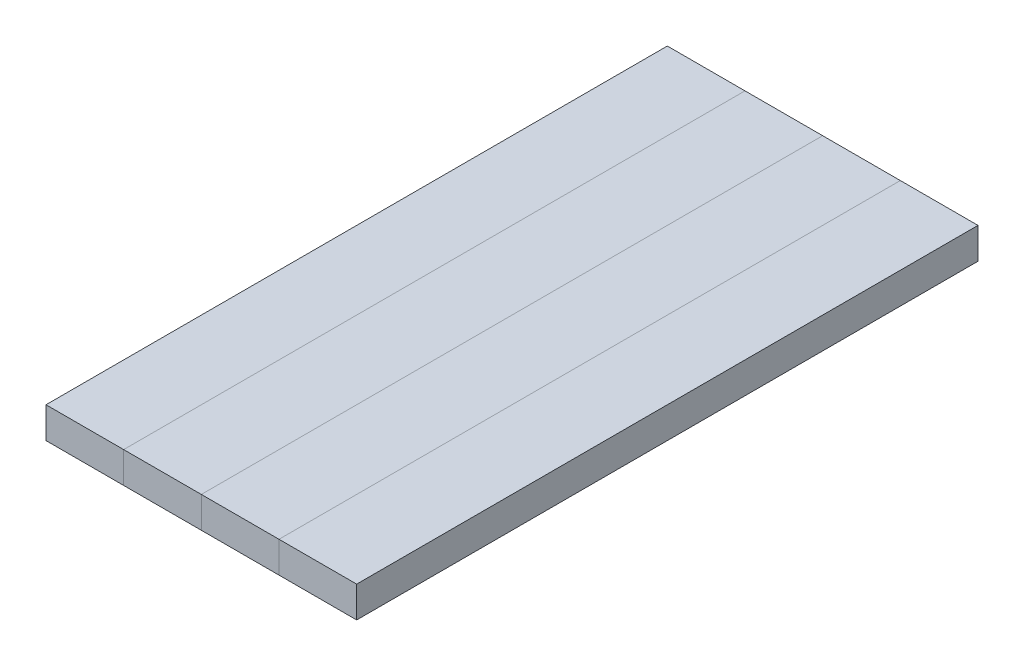
ISO-10303-21;
HEADER;
FILE_DESCRIPTION(('STEP AP214'),'2;1');
FILE_NAME('part.step','',(''),(''),'','','');
FILE_SCHEMA(('AUTOMOTIVE_DESIGN { 1 0 10303 214 1 1 1 1 }'));
ENDSEC;
DATA;
#1=APPLICATION_CONTEXT('core data for automotive mechanical design processes');
#2=APPLICATION_PROTOCOL_DEFINITION('international standard','automotive_design',2000,#1);
#3=PRODUCT_CONTEXT('',#1,'mechanical');
#4=PRODUCT('Part','Part','',(#3));
#5=PRODUCT_RELATED_PRODUCT_CATEGORY('part','',(#4));
#6=PRODUCT_DEFINITION_FORMATION('','',#4);
#7=PRODUCT_DEFINITION_CONTEXT('part definition',#1,'design');
#8=PRODUCT_DEFINITION('design','',#6,#7);
#9=PRODUCT_DEFINITION_SHAPE('','',#8);
#10=(LENGTH_UNIT() NAMED_UNIT(*) SI_UNIT(.MILLI.,.METRE.));
#11=(NAMED_UNIT(*) PLANE_ANGLE_UNIT() SI_UNIT($,.RADIAN.));
#12=(NAMED_UNIT(*) SI_UNIT($,.STERADIAN.) SOLID_ANGLE_UNIT());
#13=UNCERTAINTY_MEASURE_WITH_UNIT(LENGTH_MEASURE(1.E-05),#10,'distance_accuracy_value','');
#14=(GEOMETRIC_REPRESENTATION_CONTEXT(3) GLOBAL_UNCERTAINTY_ASSIGNED_CONTEXT((#13)) GLOBAL_UNIT_ASSIGNED_CONTEXT((#10,
#11,#12)) REPRESENTATION_CONTEXT('',''));
#15=CARTESIAN_POINT('',(0.,0.,0.));
#16=DIRECTION('',(0.,0.,1.));
#17=DIRECTION('',(1.,0.,0.));
#18=AXIS2_PLACEMENT_3D('',#15,#16,#17);
#19=CARTESIAN_POINT('',(0.,0.,0.));
#20=DIRECTION('',(0.,1.,0.));
#21=DIRECTION('',(0.,0.,1.));
#22=AXIS2_PLACEMENT_3D('',#19,#20,#21);
#23=PLANE('',#22);
#24=DIRECTION('',(0.,0.,1.));
#25=VECTOR('',#24,1.);
#26=CARTESIAN_POINT('',(-12.5,0.,-100.));
#27=LINE('',#26,#25);
#28=CARTESIAN_POINT('',(-12.5,0.,-100.));
#29=VERTEX_POINT('',#28);
#30=CARTESIAN_POINT('',(-12.5,0.,100.));
#31=VERTEX_POINT('',#30);
#32=EDGE_CURVE('P0_E79',#29,#31,#27,.T.);
#33=ORIENTED_EDGE('',*,*,#32,.F.);
#34=DIRECTION('',(-1.,0.,0.));
#35=VECTOR('',#34,1.);
#36=CARTESIAN_POINT('',(12.5,0.,-100.));
#37=LINE('',#36,#35);
#38=CARTESIAN_POINT('',(12.5,0.,-100.));
#39=VERTEX_POINT('',#38);
#40=EDGE_CURVE('P0_E55',#39,#29,#37,.T.);
#41=ORIENTED_EDGE('',*,*,#40,.F.);
#42=DIRECTION('',(0.,0.,-1.));
#43=VECTOR('',#42,1.);
#44=CARTESIAN_POINT('',(12.5,0.,100.));
#45=LINE('',#44,#43);
#46=CARTESIAN_POINT('',(12.5,0.,100.));
#47=VERTEX_POINT('',#46);
#48=EDGE_CURVE('P0_E57',#47,#39,#45,.T.);
#49=ORIENTED_EDGE('',*,*,#48,.F.);
#50=DIRECTION('',(1.,0.,0.));
#51=VECTOR('',#50,1.);
#52=CARTESIAN_POINT('',(-12.5,0.,100.));
#53=LINE('',#52,#51);
#54=EDGE_CURVE('P0_E20',#31,#47,#53,.T.);
#55=ORIENTED_EDGE('',*,*,#54,.F.);
#56=EDGE_LOOP('',(#33,#41,#49,#55));
#57=FACE_BOUND('',#56,.T.);
#58=ADVANCED_FACE('P0_F17',(#57),#23,.F.);
#59=CARTESIAN_POINT('',(-12.5,0.,100.));
#60=DIRECTION('',(0.,0.,1.));
#61=DIRECTION('',(1.,0.,0.));
#62=AXIS2_PLACEMENT_3D('',#59,#60,#61);
#63=PLANE('',#62);
#64=DIRECTION('',(1.,0.,0.));
#65=VECTOR('',#64,1.);
#66=CARTESIAN_POINT('',(0.,10.,100.));
#67=LINE('',#66,#65);
#68=CARTESIAN_POINT('',(-12.5,10.,100.));
#69=VERTEX_POINT('',#68);
#70=CARTESIAN_POINT('',(12.5,10.,100.));
#71=VERTEX_POINT('',#70);
#72=EDGE_CURVE('P0_E83',#69,#71,#67,.T.);
#73=ORIENTED_EDGE('',*,*,#72,.F.);
#74=DIRECTION('',(0.,1.,0.));
#75=VECTOR('',#74,1.);
#76=CARTESIAN_POINT('',(-12.5,0.,100.));
#77=LINE('',#76,#75);
#78=EDGE_CURVE('P0_E68',#31,#69,#77,.T.);
#79=ORIENTED_EDGE('',*,*,#78,.F.);
#80=ORIENTED_EDGE('',*,*,#54,.T.);
#81=DIRECTION('',(0.,1.,0.));
#82=VECTOR('',#81,1.);
#83=CARTESIAN_POINT('',(12.5,0.,100.));
#84=LINE('',#83,#82);
#85=EDGE_CURVE('P0_E63',#71,#47,#84,.F.);
#86=ORIENTED_EDGE('',*,*,#85,.F.);
#87=EDGE_LOOP('',(#73,#79,#80,#86));
#88=FACE_BOUND('',#87,.T.);
#89=ADVANCED_FACE('P0_F65',(#88),#63,.T.);
#90=CARTESIAN_POINT('',(12.5,0.,100.));
#91=DIRECTION('',(1.,0.,0.));
#92=DIRECTION('',(0.,0.,-1.));
#93=AXIS2_PLACEMENT_3D('',#90,#91,#92);
#94=PLANE('',#93);
#95=DIRECTION('',(0.,0.,1.));
#96=VECTOR('',#95,1.);
#97=CARTESIAN_POINT('',(12.5,10.,0.));
#98=LINE('',#97,#96);
#99=CARTESIAN_POINT('',(12.5,10.,-100.));
#100=VERTEX_POINT('',#99);
#101=EDGE_CURVE('P0_E72',#71,#100,#98,.F.);
#102=ORIENTED_EDGE('',*,*,#101,.F.);
#103=ORIENTED_EDGE('',*,*,#85,.T.);
#104=ORIENTED_EDGE('',*,*,#48,.T.);
#105=DIRECTION('',(0.,1.,0.));
#106=VECTOR('',#105,1.);
#107=CARTESIAN_POINT('',(12.5,0.,-100.));
#108=LINE('',#107,#106);
#109=EDGE_CURVE('P0_E75',#100,#39,#108,.F.);
#110=ORIENTED_EDGE('',*,*,#109,.F.);
#111=EDGE_LOOP('',(#102,#103,#104,#110));
#112=FACE_BOUND('',#111,.T.);
#113=ADVANCED_FACE('P0_F70',(#112),#94,.T.);
#114=CARTESIAN_POINT('',(12.5,0.,-100.));
#115=DIRECTION('',(0.,0.,-1.));
#116=DIRECTION('',(-1.,0.,0.));
#117=AXIS2_PLACEMENT_3D('',#114,#115,#116);
#118=PLANE('',#117);
#119=DIRECTION('',(1.,0.,0.));
#120=VECTOR('',#119,1.);
#121=CARTESIAN_POINT('',(0.,10.,-100.));
#122=LINE('',#121,#120);
#123=CARTESIAN_POINT('',(-12.5,10.,-100.));
#124=VERTEX_POINT('',#123);
#125=EDGE_CURVE('P0_E26',#100,#124,#122,.F.);
#126=ORIENTED_EDGE('',*,*,#125,.F.);
#127=ORIENTED_EDGE('',*,*,#109,.T.);
#128=ORIENTED_EDGE('',*,*,#40,.T.);
#129=DIRECTION('',(0.,1.,0.));
#130=VECTOR('',#129,1.);
#131=CARTESIAN_POINT('',(-12.5,0.,-100.));
#132=LINE('',#131,#130);
#133=EDGE_CURVE('P0_E35',#124,#29,#132,.F.);
#134=ORIENTED_EDGE('',*,*,#133,.F.);
#135=EDGE_LOOP('',(#126,#127,#128,#134));
#136=FACE_BOUND('',#135,.T.);
#137=ADVANCED_FACE('P0_F89',(#136),#118,.T.);
#138=CARTESIAN_POINT('',(-12.5,0.,-100.));
#139=DIRECTION('',(-1.,0.,0.));
#140=DIRECTION('',(0.,0.,1.));
#141=AXIS2_PLACEMENT_3D('',#138,#139,#140);
#142=PLANE('',#141);
#143=DIRECTION('',(0.,0.,1.));
#144=VECTOR('',#143,1.);
#145=CARTESIAN_POINT('',(-12.5,10.,0.));
#146=LINE('',#145,#144);
#147=EDGE_CURVE('P0_E11',#124,#69,#146,.T.);
#148=ORIENTED_EDGE('',*,*,#147,.F.);
#149=ORIENTED_EDGE('',*,*,#133,.T.);
#150=ORIENTED_EDGE('',*,*,#32,.T.);
#151=ORIENTED_EDGE('',*,*,#78,.T.);
#152=EDGE_LOOP('',(#148,#149,#150,#151));
#153=FACE_BOUND('',#152,.T.);
#154=ADVANCED_FACE('P0_F91',(#153),#142,.T.);
#155=CARTESIAN_POINT('',(0.,10.,0.));
#156=DIRECTION('',(0.,1.,0.));
#157=DIRECTION('',(0.,0.,1.));
#158=AXIS2_PLACEMENT_3D('',#155,#156,#157);
#159=PLANE('',#158);
#160=ORIENTED_EDGE('',*,*,#125,.T.);
#161=ORIENTED_EDGE('',*,*,#147,.T.);
#162=ORIENTED_EDGE('',*,*,#72,.T.);
#163=ORIENTED_EDGE('',*,*,#101,.T.);
#164=EDGE_LOOP('',(#160,#161,#162,#163));
#165=FACE_BOUND('',#164,.T.);
#166=ADVANCED_FACE('P0_F88',(#165),#159,.T.);
#167=CLOSED_SHELL('',(#58,#89,#113,#137,#154,#166));
#168=MANIFOLD_SOLID_BREP('P0_B1',#167);
#169=CARTESIAN_POINT('',(25.,0.,0.));
#170=DIRECTION('',(0.,1.,0.));
#171=DIRECTION('',(0.,0.,1.));
#172=AXIS2_PLACEMENT_3D('',#169,#170,#171);
#173=PLANE('',#172);
#174=DIRECTION('',(0.,0.,1.));
#175=VECTOR('',#174,1.);
#176=CARTESIAN_POINT('',(12.5,0.,-100.));
#177=LINE('',#176,#175);
#178=CARTESIAN_POINT('',(12.5,0.,-100.));
#179=VERTEX_POINT('',#178);
#180=CARTESIAN_POINT('',(12.5,0.,100.));
#181=VERTEX_POINT('',#180);
#182=EDGE_CURVE('P1_E79',#179,#181,#177,.T.);
#183=ORIENTED_EDGE('',*,*,#182,.F.);
#184=DIRECTION('',(-1.,0.,0.));
#185=VECTOR('',#184,1.);
#186=CARTESIAN_POINT('',(37.5,0.,-100.));
#187=LINE('',#186,#185);
#188=CARTESIAN_POINT('',(37.5,0.,-100.));
#189=VERTEX_POINT('',#188);
#190=EDGE_CURVE('P1_E55',#189,#179,#187,.T.);
#191=ORIENTED_EDGE('',*,*,#190,.F.);
#192=DIRECTION('',(0.,0.,-1.));
#193=VECTOR('',#192,1.);
#194=CARTESIAN_POINT('',(37.5,0.,100.));
#195=LINE('',#194,#193);
#196=CARTESIAN_POINT('',(37.5,0.,100.));
#197=VERTEX_POINT('',#196);
#198=EDGE_CURVE('P1_E57',#197,#189,#195,.T.);
#199=ORIENTED_EDGE('',*,*,#198,.F.);
#200=DIRECTION('',(1.,0.,0.));
#201=VECTOR('',#200,1.);
#202=CARTESIAN_POINT('',(12.5,0.,100.));
#203=LINE('',#202,#201);
#204=EDGE_CURVE('P1_E20',#181,#197,#203,.T.);
#205=ORIENTED_EDGE('',*,*,#204,.F.);
#206=EDGE_LOOP('',(#183,#191,#199,#205));
#207=FACE_BOUND('',#206,.T.);
#208=ADVANCED_FACE('P1_F17',(#207),#173,.F.);
#209=CARTESIAN_POINT('',(12.5,0.,100.));
#210=DIRECTION('',(0.,0.,1.));
#211=DIRECTION('',(1.,0.,0.));
#212=AXIS2_PLACEMENT_3D('',#209,#210,#211);
#213=PLANE('',#212);
#214=DIRECTION('',(1.,0.,0.));
#215=VECTOR('',#214,1.);
#216=CARTESIAN_POINT('',(25.,10.,100.));
#217=LINE('',#216,#215);
#218=CARTESIAN_POINT('',(12.5,10.,100.));
#219=VERTEX_POINT('',#218);
#220=CARTESIAN_POINT('',(37.5,10.,100.));
#221=VERTEX_POINT('',#220);
#222=EDGE_CURVE('P1_E83',#219,#221,#217,.T.);
#223=ORIENTED_EDGE('',*,*,#222,.F.);
#224=DIRECTION('',(0.,1.,0.));
#225=VECTOR('',#224,1.);
#226=CARTESIAN_POINT('',(12.5,0.,100.));
#227=LINE('',#226,#225);
#228=EDGE_CURVE('P1_E68',#181,#219,#227,.T.);
#229=ORIENTED_EDGE('',*,*,#228,.F.);
#230=ORIENTED_EDGE('',*,*,#204,.T.);
#231=DIRECTION('',(0.,1.,0.));
#232=VECTOR('',#231,1.);
#233=CARTESIAN_POINT('',(37.5,0.,100.));
#234=LINE('',#233,#232);
#235=EDGE_CURVE('P1_E63',#221,#197,#234,.F.);
#236=ORIENTED_EDGE('',*,*,#235,.F.);
#237=EDGE_LOOP('',(#223,#229,#230,#236));
#238=FACE_BOUND('',#237,.T.);
#239=ADVANCED_FACE('P1_F65',(#238),#213,.T.);
#240=CARTESIAN_POINT('',(37.5,0.,100.));
#241=DIRECTION('',(1.,0.,0.));
#242=DIRECTION('',(0.,0.,-1.));
#243=AXIS2_PLACEMENT_3D('',#240,#241,#242);
#244=PLANE('',#243);
#245=DIRECTION('',(0.,0.,1.));
#246=VECTOR('',#245,1.);
#247=CARTESIAN_POINT('',(37.5,10.,0.));
#248=LINE('',#247,#246);
#249=CARTESIAN_POINT('',(37.5,10.,-100.));
#250=VERTEX_POINT('',#249);
#251=EDGE_CURVE('P1_E72',#221,#250,#248,.F.);
#252=ORIENTED_EDGE('',*,*,#251,.F.);
#253=ORIENTED_EDGE('',*,*,#235,.T.);
#254=ORIENTED_EDGE('',*,*,#198,.T.);
#255=DIRECTION('',(0.,1.,0.));
#256=VECTOR('',#255,1.);
#257=CARTESIAN_POINT('',(37.5,0.,-100.));
#258=LINE('',#257,#256);
#259=EDGE_CURVE('P1_E75',#250,#189,#258,.F.);
#260=ORIENTED_EDGE('',*,*,#259,.F.);
#261=EDGE_LOOP('',(#252,#253,#254,#260));
#262=FACE_BOUND('',#261,.T.);
#263=ADVANCED_FACE('P1_F70',(#262),#244,.T.);
#264=CARTESIAN_POINT('',(37.5,0.,-100.));
#265=DIRECTION('',(0.,0.,-1.));
#266=DIRECTION('',(-1.,0.,0.));
#267=AXIS2_PLACEMENT_3D('',#264,#265,#266);
#268=PLANE('',#267);
#269=DIRECTION('',(1.,0.,0.));
#270=VECTOR('',#269,1.);
#271=CARTESIAN_POINT('',(25.,10.,-100.));
#272=LINE('',#271,#270);
#273=CARTESIAN_POINT('',(12.5,10.,-100.));
#274=VERTEX_POINT('',#273);
#275=EDGE_CURVE('P1_E26',#250,#274,#272,.F.);
#276=ORIENTED_EDGE('',*,*,#275,.F.);
#277=ORIENTED_EDGE('',*,*,#259,.T.);
#278=ORIENTED_EDGE('',*,*,#190,.T.);
#279=DIRECTION('',(0.,1.,0.));
#280=VECTOR('',#279,1.);
#281=CARTESIAN_POINT('',(12.5,0.,-100.));
#282=LINE('',#281,#280);
#283=EDGE_CURVE('P1_E35',#274,#179,#282,.F.);
#284=ORIENTED_EDGE('',*,*,#283,.F.);
#285=EDGE_LOOP('',(#276,#277,#278,#284));
#286=FACE_BOUND('',#285,.T.);
#287=ADVANCED_FACE('P1_F89',(#286),#268,.T.);
#288=CARTESIAN_POINT('',(12.5,0.,-100.));
#289=DIRECTION('',(-1.,0.,0.));
#290=DIRECTION('',(0.,0.,1.));
#291=AXIS2_PLACEMENT_3D('',#288,#289,#290);
#292=PLANE('',#291);
#293=DIRECTION('',(0.,0.,1.));
#294=VECTOR('',#293,1.);
#295=CARTESIAN_POINT('',(12.5,10.,0.));
#296=LINE('',#295,#294);
#297=EDGE_CURVE('P1_E11',#274,#219,#296,.T.);
#298=ORIENTED_EDGE('',*,*,#297,.F.);
#299=ORIENTED_EDGE('',*,*,#283,.T.);
#300=ORIENTED_EDGE('',*,*,#182,.T.);
#301=ORIENTED_EDGE('',*,*,#228,.T.);
#302=EDGE_LOOP('',(#298,#299,#300,#301));
#303=FACE_BOUND('',#302,.T.);
#304=ADVANCED_FACE('P1_F91',(#303),#292,.T.);
#305=CARTESIAN_POINT('',(25.,10.,0.));
#306=DIRECTION('',(0.,1.,0.));
#307=DIRECTION('',(0.,0.,1.));
#308=AXIS2_PLACEMENT_3D('',#305,#306,#307);
#309=PLANE('',#308);
#310=ORIENTED_EDGE('',*,*,#275,.T.);
#311=ORIENTED_EDGE('',*,*,#297,.T.);
#312=ORIENTED_EDGE('',*,*,#222,.T.);
#313=ORIENTED_EDGE('',*,*,#251,.T.);
#314=EDGE_LOOP('',(#310,#311,#312,#313));
#315=FACE_BOUND('',#314,.T.);
#316=ADVANCED_FACE('P1_F88',(#315),#309,.T.);
#317=CLOSED_SHELL('',(#208,#239,#263,#287,#304,#316));
#318=MANIFOLD_SOLID_BREP('P1_B1',#317);
#319=CARTESIAN_POINT('',(75.,0.,0.));
#320=DIRECTION('',(0.,1.,0.));
#321=DIRECTION('',(0.,0.,1.));
#322=AXIS2_PLACEMENT_3D('',#319,#320,#321);
#323=PLANE('',#322);
#324=DIRECTION('',(0.,0.,1.));
#325=VECTOR('',#324,1.);
#326=CARTESIAN_POINT('',(62.5,0.,-100.));
#327=LINE('',#326,#325);
#328=CARTESIAN_POINT('',(62.5,0.,-100.));
#329=VERTEX_POINT('',#328);
#330=CARTESIAN_POINT('',(62.5,0.,100.));
#331=VERTEX_POINT('',#330);
#332=EDGE_CURVE('P2_E79',#329,#331,#327,.T.);
#333=ORIENTED_EDGE('',*,*,#332,.F.);
#334=DIRECTION('',(-1.,0.,0.));
#335=VECTOR('',#334,1.);
#336=CARTESIAN_POINT('',(87.5,0.,-100.));
#337=LINE('',#336,#335);
#338=CARTESIAN_POINT('',(87.5,0.,-100.));
#339=VERTEX_POINT('',#338);
#340=EDGE_CURVE('P2_E55',#339,#329,#337,.T.);
#341=ORIENTED_EDGE('',*,*,#340,.F.);
#342=DIRECTION('',(0.,0.,-1.));
#343=VECTOR('',#342,1.);
#344=CARTESIAN_POINT('',(87.5,0.,100.));
#345=LINE('',#344,#343);
#346=CARTESIAN_POINT('',(87.5,0.,100.));
#347=VERTEX_POINT('',#346);
#348=EDGE_CURVE('P2_E57',#347,#339,#345,.T.);
#349=ORIENTED_EDGE('',*,*,#348,.F.);
#350=DIRECTION('',(1.,0.,0.));
#351=VECTOR('',#350,1.);
#352=CARTESIAN_POINT('',(62.5,0.,100.));
#353=LINE('',#352,#351);
#354=EDGE_CURVE('P2_E20',#331,#347,#353,.T.);
#355=ORIENTED_EDGE('',*,*,#354,.F.);
#356=EDGE_LOOP('',(#333,#341,#349,#355));
#357=FACE_BOUND('',#356,.T.);
#358=ADVANCED_FACE('P2_F17',(#357),#323,.F.);
#359=CARTESIAN_POINT('',(62.5,0.,100.));
#360=DIRECTION('',(0.,0.,1.));
#361=DIRECTION('',(1.,0.,0.));
#362=AXIS2_PLACEMENT_3D('',#359,#360,#361);
#363=PLANE('',#362);
#364=DIRECTION('',(1.,0.,0.));
#365=VECTOR('',#364,1.);
#366=CARTESIAN_POINT('',(75.,10.,100.));
#367=LINE('',#366,#365);
#368=CARTESIAN_POINT('',(62.5,10.,100.));
#369=VERTEX_POINT('',#368);
#370=CARTESIAN_POINT('',(87.5,10.,100.));
#371=VERTEX_POINT('',#370);
#372=EDGE_CURVE('P2_E83',#369,#371,#367,.T.);
#373=ORIENTED_EDGE('',*,*,#372,.F.);
#374=DIRECTION('',(0.,1.,0.));
#375=VECTOR('',#374,1.);
#376=CARTESIAN_POINT('',(62.5,0.,100.));
#377=LINE('',#376,#375);
#378=EDGE_CURVE('P2_E68',#331,#369,#377,.T.);
#379=ORIENTED_EDGE('',*,*,#378,.F.);
#380=ORIENTED_EDGE('',*,*,#354,.T.);
#381=DIRECTION('',(0.,1.,0.));
#382=VECTOR('',#381,1.);
#383=CARTESIAN_POINT('',(87.5,0.,100.));
#384=LINE('',#383,#382);
#385=EDGE_CURVE('P2_E63',#371,#347,#384,.F.);
#386=ORIENTED_EDGE('',*,*,#385,.F.);
#387=EDGE_LOOP('',(#373,#379,#380,#386));
#388=FACE_BOUND('',#387,.T.);
#389=ADVANCED_FACE('P2_F65',(#388),#363,.T.);
#390=CARTESIAN_POINT('',(87.5,0.,100.));
#391=DIRECTION('',(1.,0.,0.));
#392=DIRECTION('',(0.,0.,-1.));
#393=AXIS2_PLACEMENT_3D('',#390,#391,#392);
#394=PLANE('',#393);
#395=DIRECTION('',(0.,0.,1.));
#396=VECTOR('',#395,1.);
#397=CARTESIAN_POINT('',(87.5,10.,0.));
#398=LINE('',#397,#396);
#399=CARTESIAN_POINT('',(87.5,10.,-100.));
#400=VERTEX_POINT('',#399);
#401=EDGE_CURVE('P2_E72',#371,#400,#398,.F.);
#402=ORIENTED_EDGE('',*,*,#401,.F.);
#403=ORIENTED_EDGE('',*,*,#385,.T.);
#404=ORIENTED_EDGE('',*,*,#348,.T.);
#405=DIRECTION('',(0.,1.,0.));
#406=VECTOR('',#405,1.);
#407=CARTESIAN_POINT('',(87.5,0.,-100.));
#408=LINE('',#407,#406);
#409=EDGE_CURVE('P2_E75',#400,#339,#408,.F.);
#410=ORIENTED_EDGE('',*,*,#409,.F.);
#411=EDGE_LOOP('',(#402,#403,#404,#410));
#412=FACE_BOUND('',#411,.T.);
#413=ADVANCED_FACE('P2_F70',(#412),#394,.T.);
#414=CARTESIAN_POINT('',(87.5,0.,-100.));
#415=DIRECTION('',(0.,0.,-1.));
#416=DIRECTION('',(-1.,0.,0.));
#417=AXIS2_PLACEMENT_3D('',#414,#415,#416);
#418=PLANE('',#417);
#419=DIRECTION('',(1.,0.,0.));
#420=VECTOR('',#419,1.);
#421=CARTESIAN_POINT('',(75.,10.,-100.));
#422=LINE('',#421,#420);
#423=CARTESIAN_POINT('',(62.5,10.,-100.));
#424=VERTEX_POINT('',#423);
#425=EDGE_CURVE('P2_E26',#400,#424,#422,.F.);
#426=ORIENTED_EDGE('',*,*,#425,.F.);
#427=ORIENTED_EDGE('',*,*,#409,.T.);
#428=ORIENTED_EDGE('',*,*,#340,.T.);
#429=DIRECTION('',(0.,1.,0.));
#430=VECTOR('',#429,1.);
#431=CARTESIAN_POINT('',(62.5,0.,-100.));
#432=LINE('',#431,#430);
#433=EDGE_CURVE('P2_E35',#424,#329,#432,.F.);
#434=ORIENTED_EDGE('',*,*,#433,.F.);
#435=EDGE_LOOP('',(#426,#427,#428,#434));
#436=FACE_BOUND('',#435,.T.);
#437=ADVANCED_FACE('P2_F89',(#436),#418,.T.);
#438=CARTESIAN_POINT('',(62.5,0.,-100.));
#439=DIRECTION('',(-1.,0.,0.));
#440=DIRECTION('',(0.,0.,1.));
#441=AXIS2_PLACEMENT_3D('',#438,#439,#440);
#442=PLANE('',#441);
#443=DIRECTION('',(0.,0.,1.));
#444=VECTOR('',#443,1.);
#445=CARTESIAN_POINT('',(62.5,10.,0.));
#446=LINE('',#445,#444);
#447=EDGE_CURVE('P2_E11',#424,#369,#446,.T.);
#448=ORIENTED_EDGE('',*,*,#447,.F.);
#449=ORIENTED_EDGE('',*,*,#433,.T.);
#450=ORIENTED_EDGE('',*,*,#332,.T.);
#451=ORIENTED_EDGE('',*,*,#378,.T.);
#452=EDGE_LOOP('',(#448,#449,#450,#451));
#453=FACE_BOUND('',#452,.T.);
#454=ADVANCED_FACE('P2_F91',(#453),#442,.T.);
#455=CARTESIAN_POINT('',(75.,10.,0.));
#456=DIRECTION('',(0.,1.,0.));
#457=DIRECTION('',(0.,0.,1.));
#458=AXIS2_PLACEMENT_3D('',#455,#456,#457);
#459=PLANE('',#458);
#460=ORIENTED_EDGE('',*,*,#425,.T.);
#461=ORIENTED_EDGE('',*,*,#447,.T.);
#462=ORIENTED_EDGE('',*,*,#372,.T.);
#463=ORIENTED_EDGE('',*,*,#401,.T.);
#464=EDGE_LOOP('',(#460,#461,#462,#463));
#465=FACE_BOUND('',#464,.T.);
#466=ADVANCED_FACE('P2_F88',(#465),#459,.T.);
#467=CLOSED_SHELL('',(#358,#389,#413,#437,#454,#466));
#468=MANIFOLD_SOLID_BREP('P2_B1',#467);
#469=CARTESIAN_POINT('',(50.,0.,0.));
#470=DIRECTION('',(0.,1.,0.));
#471=DIRECTION('',(0.,0.,1.));
#472=AXIS2_PLACEMENT_3D('',#469,#470,#471);
#473=PLANE('',#472);
#474=DIRECTION('',(0.,0.,1.));
#475=VECTOR('',#474,1.);
#476=CARTESIAN_POINT('',(37.5,0.,-100.));
#477=LINE('',#476,#475);
#478=CARTESIAN_POINT('',(37.5,0.,-100.));
#479=VERTEX_POINT('',#478);
#480=CARTESIAN_POINT('',(37.5,0.,100.));
#481=VERTEX_POINT('',#480);
#482=EDGE_CURVE('P3_E78',#479,#481,#477,.T.);
#483=ORIENTED_EDGE('',*,*,#482,.F.);
#484=DIRECTION('',(-1.,0.,0.));
#485=VECTOR('',#484,1.);
#486=CARTESIAN_POINT('',(62.5,0.,-100.));
#487=LINE('',#486,#485);
#488=CARTESIAN_POINT('',(62.5,0.,-100.));
#489=VERTEX_POINT('',#488);
#490=EDGE_CURVE('P3_E54',#489,#479,#487,.T.);
#491=ORIENTED_EDGE('',*,*,#490,.F.);
#492=DIRECTION('',(0.,0.,-1.));
#493=VECTOR('',#492,1.);
#494=CARTESIAN_POINT('',(62.5,0.,100.));
#495=LINE('',#494,#493);
#496=CARTESIAN_POINT('',(62.5,0.,100.));
#497=VERTEX_POINT('',#496);
#498=EDGE_CURVE('P3_E56',#497,#489,#495,.T.);
#499=ORIENTED_EDGE('',*,*,#498,.F.);
#500=DIRECTION('',(1.,0.,0.));
#501=VECTOR('',#500,1.);
#502=CARTESIAN_POINT('',(37.5,0.,100.));
#503=LINE('',#502,#501);
#504=EDGE_CURVE('P3_E19',#481,#497,#503,.T.);
#505=ORIENTED_EDGE('',*,*,#504,.F.);
#506=EDGE_LOOP('',(#483,#491,#499,#505));
#507=FACE_BOUND('',#506,.T.);
#508=ADVANCED_FACE('P3_F16',(#507),#473,.F.);
#509=CARTESIAN_POINT('',(37.5,0.,100.));
#510=DIRECTION('',(0.,0.,1.));
#511=DIRECTION('',(1.,0.,0.));
#512=AXIS2_PLACEMENT_3D('',#509,#510,#511);
#513=PLANE('',#512);
#514=DIRECTION('',(1.,0.,0.));
#515=VECTOR('',#514,1.);
#516=CARTESIAN_POINT('',(50.,10.,100.));
#517=LINE('',#516,#515);
#518=CARTESIAN_POINT('',(37.5,10.,100.));
#519=VERTEX_POINT('',#518);
#520=CARTESIAN_POINT('',(62.5,10.,100.));
#521=VERTEX_POINT('',#520);
#522=EDGE_CURVE('P3_E82',#519,#521,#517,.T.);
#523=ORIENTED_EDGE('',*,*,#522,.F.);
#524=DIRECTION('',(0.,1.,0.));
#525=VECTOR('',#524,1.);
#526=CARTESIAN_POINT('',(37.5,0.,100.));
#527=LINE('',#526,#525);
#528=EDGE_CURVE('P3_E67',#481,#519,#527,.T.);
#529=ORIENTED_EDGE('',*,*,#528,.F.);
#530=ORIENTED_EDGE('',*,*,#504,.T.);
#531=DIRECTION('',(0.,1.,0.));
#532=VECTOR('',#531,1.);
#533=CARTESIAN_POINT('',(62.5,0.,100.));
#534=LINE('',#533,#532);
#535=EDGE_CURVE('P3_E62',#521,#497,#534,.F.);
#536=ORIENTED_EDGE('',*,*,#535,.F.);
#537=EDGE_LOOP('',(#523,#529,#530,#536));
#538=FACE_BOUND('',#537,.T.);
#539=ADVANCED_FACE('P3_F64',(#538),#513,.T.);
#540=CARTESIAN_POINT('',(62.5,0.,100.));
#541=DIRECTION('',(1.,0.,0.));
#542=DIRECTION('',(0.,0.,-1.));
#543=AXIS2_PLACEMENT_3D('',#540,#541,#542);
#544=PLANE('',#543);
#545=DIRECTION('',(0.,0.,1.));
#546=VECTOR('',#545,1.);
#547=CARTESIAN_POINT('',(62.5,10.,0.));
#548=LINE('',#547,#546);
#549=CARTESIAN_POINT('',(62.5,10.,-100.));
#550=VERTEX_POINT('',#549);
#551=EDGE_CURVE('P3_E71',#521,#550,#548,.F.);
#552=ORIENTED_EDGE('',*,*,#551,.F.);
#553=ORIENTED_EDGE('',*,*,#535,.T.);
#554=ORIENTED_EDGE('',*,*,#498,.T.);
#555=DIRECTION('',(0.,1.,0.));
#556=VECTOR('',#555,1.);
#557=CARTESIAN_POINT('',(62.5,0.,-100.));
#558=LINE('',#557,#556);
#559=EDGE_CURVE('P3_E74',#550,#489,#558,.F.);
#560=ORIENTED_EDGE('',*,*,#559,.F.);
#561=EDGE_LOOP('',(#552,#553,#554,#560));
#562=FACE_BOUND('',#561,.T.);
#563=ADVANCED_FACE('P3_F69',(#562),#544,.T.);
#564=CARTESIAN_POINT('',(62.5,0.,-100.));
#565=DIRECTION('',(0.,0.,-1.));
#566=DIRECTION('',(-1.,0.,0.));
#567=AXIS2_PLACEMENT_3D('',#564,#565,#566);
#568=PLANE('',#567);
#569=DIRECTION('',(1.,0.,0.));
#570=VECTOR('',#569,1.);
#571=CARTESIAN_POINT('',(50.,10.,-100.));
#572=LINE('',#571,#570);
#573=CARTESIAN_POINT('',(37.5,10.,-100.));
#574=VERTEX_POINT('',#573);
#575=EDGE_CURVE('P3_E25',#550,#574,#572,.F.);
#576=ORIENTED_EDGE('',*,*,#575,.F.);
#577=ORIENTED_EDGE('',*,*,#559,.T.);
#578=ORIENTED_EDGE('',*,*,#490,.T.);
#579=DIRECTION('',(0.,1.,0.));
#580=VECTOR('',#579,1.);
#581=CARTESIAN_POINT('',(37.5,0.,-100.));
#582=LINE('',#581,#580);
#583=EDGE_CURVE('P3_E34',#574,#479,#582,.F.);
#584=ORIENTED_EDGE('',*,*,#583,.F.);
#585=EDGE_LOOP('',(#576,#577,#578,#584));
#586=FACE_BOUND('',#585,.T.);
#587=ADVANCED_FACE('P3_F88',(#586),#568,.T.);
#588=CARTESIAN_POINT('',(37.5,0.,-100.));
#589=DIRECTION('',(-1.,0.,0.));
#590=DIRECTION('',(0.,0.,1.));
#591=AXIS2_PLACEMENT_3D('',#588,#589,#590);
#592=PLANE('',#591);
#593=DIRECTION('',(0.,0.,1.));
#594=VECTOR('',#593,1.);
#595=CARTESIAN_POINT('',(37.5,10.,0.));
#596=LINE('',#595,#594);
#597=EDGE_CURVE('P3_E10',#574,#519,#596,.T.);
#598=ORIENTED_EDGE('',*,*,#597,.F.);
#599=ORIENTED_EDGE('',*,*,#583,.T.);
#600=ORIENTED_EDGE('',*,*,#482,.T.);
#601=ORIENTED_EDGE('',*,*,#528,.T.);
#602=EDGE_LOOP('',(#598,#599,#600,#601));
#603=FACE_BOUND('',#602,.T.);
#604=ADVANCED_FACE('P3_F90',(#603),#592,.T.);
#605=CARTESIAN_POINT('',(50.,10.,0.));
#606=DIRECTION('',(0.,1.,0.));
#607=DIRECTION('',(0.,0.,1.));
#608=AXIS2_PLACEMENT_3D('',#605,#606,#607);
#609=PLANE('',#608);
#610=ORIENTED_EDGE('',*,*,#575,.T.);
#611=ORIENTED_EDGE('',*,*,#597,.T.);
#612=ORIENTED_EDGE('',*,*,#522,.T.);
#613=ORIENTED_EDGE('',*,*,#551,.T.);
#614=EDGE_LOOP('',(#610,#611,#612,#613));
#615=FACE_BOUND('',#614,.T.);
#616=ADVANCED_FACE('P3_F87',(#615),#609,.T.);
#617=CLOSED_SHELL('',(#508,#539,#563,#587,#604,#616));
#618=MANIFOLD_SOLID_BREP('P3_B1',#617);
#619=ADVANCED_BREP_SHAPE_REPRESENTATION('',(#18,#168,#318,#468,#618),#14);
#620=SHAPE_DEFINITION_REPRESENTATION(#9,#619);
ENDSEC;
END-ISO-10303-21;
